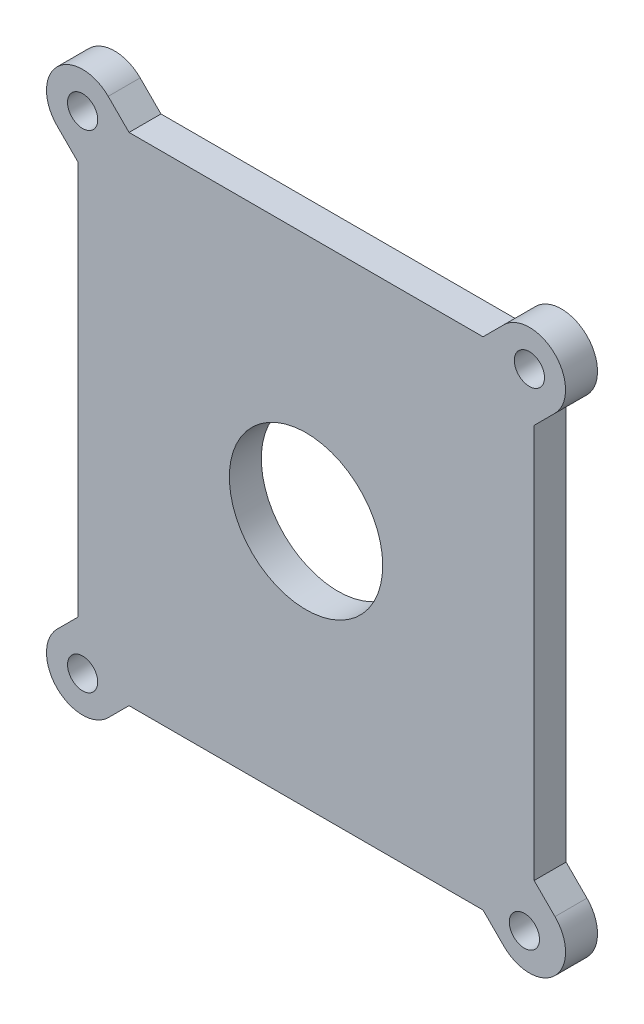
ISO-10303-21;
HEADER;
FILE_DESCRIPTION(('STEP AP214'),'2;1');
FILE_NAME('part.step','',(''),(''),'','','');
FILE_SCHEMA(('AUTOMOTIVE_DESIGN { 1 0 10303 214 1 1 1 1 }'));
ENDSEC;
DATA;
#1=APPLICATION_CONTEXT('core data for automotive mechanical design processes');
#2=APPLICATION_PROTOCOL_DEFINITION('international standard','automotive_design',2000,#1);
#3=PRODUCT_CONTEXT('',#1,'mechanical');
#4=PRODUCT('Part','Part','',(#3));
#5=PRODUCT_RELATED_PRODUCT_CATEGORY('part','',(#4));
#6=PRODUCT_DEFINITION_FORMATION('','',#4);
#7=PRODUCT_DEFINITION_CONTEXT('part definition',#1,'design');
#8=PRODUCT_DEFINITION('design','',#6,#7);
#9=PRODUCT_DEFINITION_SHAPE('','',#8);
#10=(LENGTH_UNIT() NAMED_UNIT(*) SI_UNIT(.MILLI.,.METRE.));
#11=(NAMED_UNIT(*) PLANE_ANGLE_UNIT() SI_UNIT($,.RADIAN.));
#12=(NAMED_UNIT(*) SI_UNIT($,.STERADIAN.) SOLID_ANGLE_UNIT());
#13=UNCERTAINTY_MEASURE_WITH_UNIT(LENGTH_MEASURE(1.E-05),#10,'distance_accuracy_value','');
#14=(GEOMETRIC_REPRESENTATION_CONTEXT(3) GLOBAL_UNCERTAINTY_ASSIGNED_CONTEXT((#13)) GLOBAL_UNIT_ASSIGNED_CONTEXT((#10,
#11,#12)) REPRESENTATION_CONTEXT('',''));
#15=CARTESIAN_POINT('',(0.,0.,0.));
#16=DIRECTION('',(0.,0.,1.));
#17=DIRECTION('',(1.,0.,0.));
#18=AXIS2_PLACEMENT_3D('',#15,#16,#17);
#19=CARTESIAN_POINT('',(-33.9979,0.,4.7625));
#20=DIRECTION('',(-1.,0.,0.));
#21=DIRECTION('',(0.,0.,1.));
#22=AXIS2_PLACEMENT_3D('',#19,#20,#21);
#23=PLANE('',#22);
#24=DIRECTION('',(0.,1.,0.));
#25=VECTOR('',#24,1.);
#26=CARTESIAN_POINT('',(-33.9979,0.,0.));
#27=LINE('',#26,#25);
#28=CARTESIAN_POINT('',(-33.9979,-29.3751,0.));
#29=VERTEX_POINT('',#28);
#30=CARTESIAN_POINT('',(-33.9979,29.3751,0.));
#31=VERTEX_POINT('',#30);
#32=EDGE_CURVE('E179',#29,#31,#27,.T.);
#33=ORIENTED_EDGE('',*,*,#32,.F.);
#34=DIRECTION('',(0.,0.,-1.));
#35=VECTOR('',#34,1.);
#36=CARTESIAN_POINT('',(-33.9979,-29.3751,4.7625));
#37=LINE('',#36,#35);
#38=CARTESIAN_POINT('',(-33.9979,-29.3751,4.7625));
#39=VERTEX_POINT('',#38);
#40=EDGE_CURVE('E166',#39,#29,#37,.T.);
#41=ORIENTED_EDGE('',*,*,#40,.F.);
#42=DIRECTION('',(0.,1.,0.));
#43=VECTOR('',#42,1.);
#44=CARTESIAN_POINT('',(-33.9979,0.,4.7625));
#45=LINE('',#44,#43);
#46=CARTESIAN_POINT('',(-33.9979,29.3751,4.7625));
#47=VERTEX_POINT('',#46);
#48=EDGE_CURVE('E177',#39,#47,#45,.T.);
#49=ORIENTED_EDGE('',*,*,#48,.T.);
#50=DIRECTION('',(0.,0.,-1.));
#51=VECTOR('',#50,1.);
#52=CARTESIAN_POINT('',(-33.9979,29.3751,4.7625));
#53=LINE('',#52,#51);
#54=EDGE_CURVE('E268',#47,#31,#53,.T.);
#55=ORIENTED_EDGE('',*,*,#54,.T.);
#56=EDGE_LOOP('',(#33,#41,#49,#55));
#57=FACE_BOUND('',#56,.T.);
#58=ADVANCED_FACE('F36',(#57),#23,.T.);
#59=CARTESIAN_POINT('',(0.,36.9951,4.7625));
#60=DIRECTION('',(0.,1.,0.));
#61=DIRECTION('',(0.,0.,1.));
#62=AXIS2_PLACEMENT_3D('',#59,#60,#61);
#63=PLANE('',#62);
#64=DIRECTION('',(1.,0.,0.));
#65=VECTOR('',#64,1.);
#66=CARTESIAN_POINT('',(0.,36.9951,0.));
#67=LINE('',#66,#65);
#68=CARTESIAN_POINT('',(-26.3779,36.9951,0.));
#69=VERTEX_POINT('',#68);
#70=CARTESIAN_POINT('',(26.3779,36.9951,0.));
#71=VERTEX_POINT('',#70);
#72=EDGE_CURVE('E207',#69,#71,#67,.T.);
#73=ORIENTED_EDGE('',*,*,#72,.F.);
#74=DIRECTION('',(0.,0.,-1.));
#75=VECTOR('',#74,1.);
#76=CARTESIAN_POINT('',(-26.3779,36.9951,4.7625));
#77=LINE('',#76,#75);
#78=CARTESIAN_POINT('',(-26.3779,36.9951,4.7625));
#79=VERTEX_POINT('',#78);
#80=EDGE_CURVE('E254',#79,#69,#77,.T.);
#81=ORIENTED_EDGE('',*,*,#80,.F.);
#82=DIRECTION('',(1.,0.,0.));
#83=VECTOR('',#82,1.);
#84=CARTESIAN_POINT('',(0.,36.9951,4.7625));
#85=LINE('',#84,#83);
#86=CARTESIAN_POINT('',(26.3779,36.9951,4.7625));
#87=VERTEX_POINT('',#86);
#88=EDGE_CURVE('E188',#79,#87,#85,.T.);
#89=ORIENTED_EDGE('',*,*,#88,.T.);
#90=DIRECTION('',(0.,0.,-1.));
#91=VECTOR('',#90,1.);
#92=CARTESIAN_POINT('',(26.3779,36.9951,4.7625));
#93=LINE('',#92,#91);
#94=EDGE_CURVE('E240',#87,#71,#93,.T.);
#95=ORIENTED_EDGE('',*,*,#94,.T.);
#96=EDGE_LOOP('',(#73,#81,#89,#95));
#97=FACE_BOUND('',#96,.T.);
#98=ADVANCED_FACE('F353',(#97),#63,.T.);
#99=CARTESIAN_POINT('',(33.9979,0.,4.7625));
#100=DIRECTION('',(1.,0.,0.));
#101=DIRECTION('',(0.,1.,0.));
#102=AXIS2_PLACEMENT_3D('',#99,#100,#101);
#103=PLANE('',#102);
#104=DIRECTION('',(0.,-1.,0.));
#105=VECTOR('',#104,1.);
#106=CARTESIAN_POINT('',(33.9979,0.,0.));
#107=LINE('',#106,#105);
#108=CARTESIAN_POINT('',(33.9979,29.3751,0.));
#109=VERTEX_POINT('',#108);
#110=CARTESIAN_POINT('',(33.9979,-29.3751,0.));
#111=VERTEX_POINT('',#110);
#112=EDGE_CURVE('E80',#109,#111,#107,.T.);
#113=ORIENTED_EDGE('',*,*,#112,.F.);
#114=DIRECTION('',(0.,0.,-1.));
#115=VECTOR('',#114,1.);
#116=CARTESIAN_POINT('',(33.9979,29.3751,4.7625));
#117=LINE('',#116,#115);
#118=CARTESIAN_POINT('',(33.9979,29.3751,4.7625));
#119=VERTEX_POINT('',#118);
#120=EDGE_CURVE('E198',#119,#109,#117,.T.);
#121=ORIENTED_EDGE('',*,*,#120,.F.);
#122=DIRECTION('',(0.,-1.,0.));
#123=VECTOR('',#122,1.);
#124=CARTESIAN_POINT('',(33.9979,0.,4.7625));
#125=LINE('',#124,#123);
#126=CARTESIAN_POINT('',(33.9979,-29.3751,4.7625));
#127=VERTEX_POINT('',#126);
#128=EDGE_CURVE('E53',#119,#127,#125,.T.);
#129=ORIENTED_EDGE('',*,*,#128,.T.);
#130=DIRECTION('',(0.,0.,-1.));
#131=VECTOR('',#130,1.);
#132=CARTESIAN_POINT('',(33.9979,-29.3751,4.7625));
#133=LINE('',#132,#131);
#134=EDGE_CURVE('E187',#127,#111,#133,.T.);
#135=ORIENTED_EDGE('',*,*,#134,.T.);
#136=EDGE_LOOP('',(#113,#121,#129,#135));
#137=FACE_BOUND('',#136,.T.);
#138=ADVANCED_FACE('F358',(#137),#103,.T.);
#139=CARTESIAN_POINT('',(0.,-36.9951,4.7625));
#140=DIRECTION('',(0.,1.,0.));
#141=DIRECTION('',(0.,0.,1.));
#142=AXIS2_PLACEMENT_3D('',#139,#140,#141);
#143=PLANE('',#142);
#144=DIRECTION('',(1.,0.,0.));
#145=VECTOR('',#144,1.);
#146=CARTESIAN_POINT('',(0.,-36.9951,4.7625));
#147=LINE('',#146,#145);
#148=CARTESIAN_POINT('',(-26.3779,-36.9951,4.7625));
#149=VERTEX_POINT('',#148);
#150=CARTESIAN_POINT('',(26.3779,-36.9951,4.7625));
#151=VERTEX_POINT('',#150);
#152=EDGE_CURVE('E87',#149,#151,#147,.T.);
#153=ORIENTED_EDGE('',*,*,#152,.F.);
#154=DIRECTION('',(0.,0.,-1.));
#155=VECTOR('',#154,1.);
#156=CARTESIAN_POINT('',(-26.3779,-36.9951,4.7625));
#157=LINE('',#156,#155);
#158=CARTESIAN_POINT('',(-26.3779,-36.9951,0.));
#159=VERTEX_POINT('',#158);
#160=EDGE_CURVE('E285',#149,#159,#157,.T.);
#161=ORIENTED_EDGE('',*,*,#160,.T.);
#162=DIRECTION('',(1.,0.,0.));
#163=VECTOR('',#162,1.);
#164=CARTESIAN_POINT('',(0.,-36.9951,0.));
#165=LINE('',#164,#163);
#166=CARTESIAN_POINT('',(26.3779,-36.9951,0.));
#167=VERTEX_POINT('',#166);
#168=EDGE_CURVE('E197',#159,#167,#165,.T.);
#169=ORIENTED_EDGE('',*,*,#168,.T.);
#170=DIRECTION('',(0.,0.,-1.));
#171=VECTOR('',#170,1.);
#172=CARTESIAN_POINT('',(26.3779,-36.9951,4.7625));
#173=LINE('',#172,#171);
#174=EDGE_CURVE('E11',#151,#167,#173,.T.);
#175=ORIENTED_EDGE('',*,*,#174,.F.);
#176=EDGE_LOOP('',(#153,#161,#169,#175));
#177=FACE_BOUND('',#176,.T.);
#178=ADVANCED_FACE('F365',(#177),#143,.F.);
#179=CARTESIAN_POINT('',(-5.30860000000003,-5.30860000000004,4.7625));
#180=DIRECTION('',(0.707106781186547,0.707106781186548,0.));
#181=DIRECTION('',(-0.707106781186548,0.707106781186547,0.));
#182=AXIS2_PLACEMENT_3D('',#179,#180,#181);
#183=PLANE('',#182);
#184=DIRECTION('',(0.707106781186548,-0.707106781186547,0.));
#185=VECTOR('',#184,1.);
#186=CARTESIAN_POINT('',(-5.30860000000003,-5.30860000000004,0.));
#187=LINE('',#186,#185);
#188=CARTESIAN_POINT('',(29.4838743299566,-40.1010743299566,0.));
#189=VERTEX_POINT('',#188);
#190=EDGE_CURVE('E200',#167,#189,#187,.T.);
#191=ORIENTED_EDGE('',*,*,#190,.T.);
#192=DIRECTION('',(0.,0.,-1.));
#193=VECTOR('',#192,1.);
#194=CARTESIAN_POINT('',(29.4838743299566,-40.1010743299566,4.7625));
#195=LINE('',#194,#193);
#196=CARTESIAN_POINT('',(29.4838743299566,-40.1010743299566,4.7625));
#197=VERTEX_POINT('',#196);
#198=EDGE_CURVE('E45',#197,#189,#195,.T.);
#199=ORIENTED_EDGE('',*,*,#198,.F.);
#200=DIRECTION('',(0.707106781186548,-0.707106781186547,0.));
#201=VECTOR('',#200,1.);
#202=CARTESIAN_POINT('',(-5.30860000000003,-5.30860000000004,4.7625));
#203=LINE('',#202,#201);
#204=EDGE_CURVE('E227',#151,#197,#203,.T.);
#205=ORIENTED_EDGE('',*,*,#204,.F.);
#206=ORIENTED_EDGE('',*,*,#174,.T.);
#207=EDGE_LOOP('',(#191,#199,#205,#206));
#208=FACE_BOUND('',#207,.T.);
#209=ADVANCED_FACE('F370',(#208),#183,.F.);
#210=CARTESIAN_POINT('',(33.2938743299567,-36.2910743299567,4.7625));
#211=DIRECTION('',(0.,0.,-1.));
#212=DIRECTION('',(-1.,0.,0.));
#213=AXIS2_PLACEMENT_3D('',#210,#211,#212);
#214=CYLINDRICAL_SURFACE('',#213,5.38815367264139);
#215=CARTESIAN_POINT('',(33.2938743299567,-36.2910743299567,0.));
#216=DIRECTION('',(0.,0.,1.));
#217=DIRECTION('',(1.,0.,0.));
#218=AXIS2_PLACEMENT_3D('',#215,#216,#217);
#219=CIRCLE('',#218,5.38815367264139);
#220=CARTESIAN_POINT('',(37.1038743299566,-32.4810743299569,0.));
#221=VERTEX_POINT('',#220);
#222=EDGE_CURVE('E202',#189,#221,#219,.T.);
#223=ORIENTED_EDGE('',*,*,#222,.T.);
#224=DIRECTION('',(0.,0.,-1.));
#225=VECTOR('',#224,1.);
#226=CARTESIAN_POINT('',(37.1038743299566,-32.4810743299569,4.7625));
#227=LINE('',#226,#225);
#228=CARTESIAN_POINT('',(37.1038743299566,-32.4810743299569,4.7625));
#229=VERTEX_POINT('',#228);
#230=EDGE_CURVE('E72',#229,#221,#227,.T.);
#231=ORIENTED_EDGE('',*,*,#230,.F.);
#232=CARTESIAN_POINT('',(33.2938743299567,-36.2910743299567,4.7625));
#233=DIRECTION('',(0.,0.,1.));
#234=DIRECTION('',(1.,0.,0.));
#235=AXIS2_PLACEMENT_3D('',#232,#233,#234);
#236=CIRCLE('',#235,5.38815367264139);
#237=EDGE_CURVE('E217',#197,#229,#236,.T.);
#238=ORIENTED_EDGE('',*,*,#237,.F.);
#239=ORIENTED_EDGE('',*,*,#198,.T.);
#240=EDGE_LOOP('',(#223,#231,#238,#239));
#241=FACE_BOUND('',#240,.T.);
#242=ADVANCED_FACE('F216',(#241),#214,.T.);
#243=CARTESIAN_POINT('',(2.31140000000166,2.31140000000143,4.7625));
#244=DIRECTION('',(0.707106781186582,0.707106781186513,0.));
#245=DIRECTION('',(-0.707106781186513,0.707106781186582,0.));
#246=AXIS2_PLACEMENT_3D('',#243,#244,#245);
#247=PLANE('',#246);
#248=DIRECTION('',(0.707106781186513,-0.707106781186582,0.));
#249=VECTOR('',#248,1.);
#250=CARTESIAN_POINT('',(2.31140000000166,2.31140000000143,0.));
#251=LINE('',#250,#249);
#252=EDGE_CURVE('E204',#111,#221,#251,.T.);
#253=ORIENTED_EDGE('',*,*,#252,.F.);
#254=ORIENTED_EDGE('',*,*,#134,.F.);
#255=DIRECTION('',(0.707106781186513,-0.707106781186582,0.));
#256=VECTOR('',#255,1.);
#257=CARTESIAN_POINT('',(2.31140000000166,2.31140000000143,4.7625));
#258=LINE('',#257,#256);
#259=EDGE_CURVE('E225',#127,#229,#258,.T.);
#260=ORIENTED_EDGE('',*,*,#259,.T.);
#261=ORIENTED_EDGE('',*,*,#230,.T.);
#262=EDGE_LOOP('',(#253,#254,#260,#261));
#263=FACE_BOUND('',#262,.T.);
#264=ADVANCED_FACE('F223',(#263),#247,.T.);
#265=CARTESIAN_POINT('',(0.,0.,4.7625));
#266=DIRECTION('',(0.,0.,-1.));
#267=DIRECTION('',(-1.,0.,0.));
#268=AXIS2_PLACEMENT_3D('',#265,#266,#267);
#269=CYLINDRICAL_SURFACE('',#268,11.43);
#270=CARTESIAN_POINT('',(0.,0.,4.7625));
#271=DIRECTION('',(0.,0.,1.));
#272=DIRECTION('',(1.,0.,0.));
#273=AXIS2_PLACEMENT_3D('',#270,#271,#272);
#274=CIRCLE('',#273,11.43);
#275=CARTESIAN_POINT('',(11.43,0.,4.7625));
#276=VERTEX_POINT('',#275);
#277=EDGE_CURVE('E209',#276,#276,#274,.T.);
#278=ORIENTED_EDGE('',*,*,#277,.T.);
#279=EDGE_LOOP('',(#278));
#280=FACE_BOUND('',#279,.T.);
#281=CARTESIAN_POINT('',(0.,0.,0.));
#282=DIRECTION('',(0.,0.,1.));
#283=DIRECTION('',(1.,0.,0.));
#284=AXIS2_PLACEMENT_3D('',#281,#282,#283);
#285=CIRCLE('',#284,11.43);
#286=CARTESIAN_POINT('',(11.43,0.,0.));
#287=VERTEX_POINT('',#286);
#288=EDGE_CURVE('E194',#287,#287,#285,.T.);
#289=ORIENTED_EDGE('',*,*,#288,.F.);
#290=EDGE_LOOP('',(#289));
#291=FACE_BOUND('',#290,.T.);
#292=ADVANCED_FACE('F38',(#280,#291),#269,.F.);
#293=CARTESIAN_POINT('',(0.,0.,4.7625));
#294=DIRECTION('',(0.,0.,1.));
#295=DIRECTION('',(1.,0.,0.));
#296=AXIS2_PLACEMENT_3D('',#293,#294,#295);
#297=PLANE('',#296);
#298=CARTESIAN_POINT('',(-33.2938743299567,36.2910743299567,4.7625));
#299=DIRECTION('',(0.,0.,1.));
#300=DIRECTION('',(1.,0.,0.));
#301=AXIS2_PLACEMENT_3D('',#298,#299,#300);
#302=CIRCLE('',#301,2.24999999999999);
#303=CARTESIAN_POINT('',(-31.0438743299567,36.2910743299567,4.7625));
#304=VERTEX_POINT('',#303);
#305=EDGE_CURVE('E320',#304,#304,#302,.T.);
#306=ORIENTED_EDGE('',*,*,#305,.F.);
#307=EDGE_LOOP('',(#306));
#308=FACE_BOUND('',#307,.T.);
#309=CARTESIAN_POINT('',(33.2938743299567,36.2910743299567,4.7625));
#310=DIRECTION('',(0.,0.,1.));
#311=DIRECTION('',(1.,0.,0.));
#312=AXIS2_PLACEMENT_3D('',#309,#310,#311);
#313=CIRCLE('',#312,2.24999999999999);
#314=CARTESIAN_POINT('',(35.5438743299567,36.2910743299567,4.7625));
#315=VERTEX_POINT('',#314);
#316=EDGE_CURVE('E314',#315,#315,#313,.T.);
#317=ORIENTED_EDGE('',*,*,#316,.F.);
#318=EDGE_LOOP('',(#317));
#319=FACE_BOUND('',#318,.T.);
#320=CARTESIAN_POINT('',(32.5471646817301,-36.5866527319255,4.7625));
#321=DIRECTION('',(0.,0.,1.));
#322=DIRECTION('',(1.,0.,0.));
#323=AXIS2_PLACEMENT_3D('',#320,#321,#322);
#324=CIRCLE('',#323,2.24999999999999);
#325=CARTESIAN_POINT('',(34.7971646817301,-36.5866527319255,4.7625));
#326=VERTEX_POINT('',#325);
#327=EDGE_CURVE('E308',#326,#326,#324,.T.);
#328=ORIENTED_EDGE('',*,*,#327,.F.);
#329=EDGE_LOOP('',(#328));
#330=FACE_BOUND('',#329,.T.);
#331=CARTESIAN_POINT('',(-33.2938743299567,-36.2910743299567,4.7625));
#332=DIRECTION('',(0.,0.,1.));
#333=DIRECTION('',(1.,0.,0.));
#334=AXIS2_PLACEMENT_3D('',#331,#332,#333);
#335=CIRCLE('',#334,2.24999999999999);
#336=CARTESIAN_POINT('',(-31.0438743299567,-36.2910743299567,4.7625));
#337=VERTEX_POINT('',#336);
#338=EDGE_CURVE('E302',#337,#337,#335,.T.);
#339=ORIENTED_EDGE('',*,*,#338,.F.);
#340=EDGE_LOOP('',(#339));
#341=FACE_BOUND('',#340,.T.);
#342=DIRECTION('',(-0.707106781186548,-0.707106781186547,0.));
#343=VECTOR('',#342,1.);
#344=CARTESIAN_POINT('',(5.30860000000003,-5.30860000000004,4.7625));
#345=LINE('',#344,#343);
#346=CARTESIAN_POINT('',(-29.4838743299566,-40.1010743299566,4.7625));
#347=VERTEX_POINT('',#346);
#348=EDGE_CURVE('E288',#149,#347,#345,.T.);
#349=ORIENTED_EDGE('',*,*,#348,.F.);
#350=ORIENTED_EDGE('',*,*,#152,.T.);
#351=ORIENTED_EDGE('',*,*,#204,.T.);
#352=ORIENTED_EDGE('',*,*,#237,.T.);
#353=ORIENTED_EDGE('',*,*,#259,.F.);
#354=ORIENTED_EDGE('',*,*,#128,.F.);
#355=DIRECTION('',(0.707106781186513,0.707106781186582,0.));
#356=VECTOR('',#355,1.);
#357=CARTESIAN_POINT('',(2.31140000000166,-2.31140000000143,4.7625));
#358=LINE('',#357,#356);
#359=CARTESIAN_POINT('',(37.1038743299566,32.4810743299569,4.7625));
#360=VERTEX_POINT('',#359);
#361=EDGE_CURVE('E247',#119,#360,#358,.T.);
#362=ORIENTED_EDGE('',*,*,#361,.T.);
#363=CARTESIAN_POINT('',(33.2938743299567,36.2910743299567,4.7625));
#364=DIRECTION('',(0.,0.,-1.));
#365=DIRECTION('',(1.,0.,0.));
#366=AXIS2_PLACEMENT_3D('',#363,#364,#365);
#367=CIRCLE('',#366,5.38815367264139);
#368=CARTESIAN_POINT('',(29.4838743299566,40.1010743299566,4.7625));
#369=VERTEX_POINT('',#368);
#370=EDGE_CURVE('E257',#369,#360,#367,.T.);
#371=ORIENTED_EDGE('',*,*,#370,.F.);
#372=DIRECTION('',(0.707106781186548,0.707106781186547,0.));
#373=VECTOR('',#372,1.);
#374=CARTESIAN_POINT('',(-5.30860000000003,5.30860000000004,4.7625));
#375=LINE('',#374,#373);
#376=EDGE_CURVE('E243',#87,#369,#375,.T.);
#377=ORIENTED_EDGE('',*,*,#376,.F.);
#378=ORIENTED_EDGE('',*,*,#88,.F.);
#379=DIRECTION('',(-0.707106781186548,0.707106781186547,0.));
#380=VECTOR('',#379,1.);
#381=CARTESIAN_POINT('',(5.30860000000003,5.30860000000004,4.7625));
#382=LINE('',#381,#380);
#383=CARTESIAN_POINT('',(-29.4838743299566,40.1010743299566,4.7625));
#384=VERTEX_POINT('',#383);
#385=EDGE_CURVE('E273',#79,#384,#382,.T.);
#386=ORIENTED_EDGE('',*,*,#385,.T.);
#387=CARTESIAN_POINT('',(-33.2938743299567,36.2910743299567,4.7625));
#388=DIRECTION('',(0.,0.,1.));
#389=DIRECTION('',(-1.,0.,0.));
#390=AXIS2_PLACEMENT_3D('',#387,#388,#389);
#391=CIRCLE('',#390,5.38815367264139);
#392=CARTESIAN_POINT('',(-37.1038743299566,32.4810743299569,4.7625));
#393=VERTEX_POINT('',#392);
#394=EDGE_CURVE('E279',#384,#393,#391,.T.);
#395=ORIENTED_EDGE('',*,*,#394,.T.);
#396=DIRECTION('',(-0.707106781186513,0.707106781186582,0.));
#397=VECTOR('',#396,1.);
#398=CARTESIAN_POINT('',(-2.31140000000166,-2.31140000000143,4.7625));
#399=LINE('',#398,#397);
#400=EDGE_CURVE('E186',#47,#393,#399,.T.);
#401=ORIENTED_EDGE('',*,*,#400,.F.);
#402=ORIENTED_EDGE('',*,*,#48,.F.);
#403=DIRECTION('',(-0.707106781186513,-0.707106781186582,0.));
#404=VECTOR('',#403,1.);
#405=CARTESIAN_POINT('',(-2.31140000000166,2.31140000000143,4.7625));
#406=LINE('',#405,#404);
#407=CARTESIAN_POINT('',(-37.1038743299566,-32.4810743299569,4.7625));
#408=VERTEX_POINT('',#407);
#409=EDGE_CURVE('E162',#39,#408,#406,.T.);
#410=ORIENTED_EDGE('',*,*,#409,.T.);
#411=CARTESIAN_POINT('',(-33.2938743299567,-36.2910743299567,4.7625));
#412=DIRECTION('',(0.,0.,-1.));
#413=DIRECTION('',(-1.,0.,0.));
#414=AXIS2_PLACEMENT_3D('',#411,#412,#413);
#415=CIRCLE('',#414,5.38815367264139);
#416=EDGE_CURVE('E172',#347,#408,#415,.T.);
#417=ORIENTED_EDGE('',*,*,#416,.F.);
#418=EDGE_LOOP('',(#349,#350,#351,#352,#353,#354,#362,#371,#377,#378,#386,#395,#401,#402,#410,#417));
#419=FACE_BOUND('',#418,.T.);
#420=ORIENTED_EDGE('',*,*,#277,.F.);
#421=EDGE_LOOP('',(#420));
#422=FACE_BOUND('',#421,.T.);
#423=ADVANCED_FACE('F183',(#308,#319,#330,#341,#419,#422),#297,.T.);
#424=CARTESIAN_POINT('',(0.,0.,0.));
#425=DIRECTION('',(0.,0.,1.));
#426=DIRECTION('',(1.,0.,0.));
#427=AXIS2_PLACEMENT_3D('',#424,#425,#426);
#428=PLANE('',#427);
#429=CARTESIAN_POINT('',(-33.2938743299567,36.2910743299567,0.));
#430=DIRECTION('',(0.,0.,1.));
#431=DIRECTION('',(1.,0.,0.));
#432=AXIS2_PLACEMENT_3D('',#429,#430,#431);
#433=CIRCLE('',#432,2.25);
#434=CARTESIAN_POINT('',(-31.0438743299567,36.2910743299567,0.));
#435=VERTEX_POINT('',#434);
#436=EDGE_CURVE('E317',#435,#435,#433,.T.);
#437=ORIENTED_EDGE('',*,*,#436,.T.);
#438=EDGE_LOOP('',(#437));
#439=FACE_BOUND('',#438,.T.);
#440=CARTESIAN_POINT('',(33.2938743299567,36.2910743299567,0.));
#441=DIRECTION('',(0.,0.,1.));
#442=DIRECTION('',(1.,0.,0.));
#443=AXIS2_PLACEMENT_3D('',#440,#441,#442);
#444=CIRCLE('',#443,2.25);
#445=CARTESIAN_POINT('',(35.5438743299567,36.2910743299567,0.));
#446=VERTEX_POINT('',#445);
#447=EDGE_CURVE('E311',#446,#446,#444,.T.);
#448=ORIENTED_EDGE('',*,*,#447,.T.);
#449=EDGE_LOOP('',(#448));
#450=FACE_BOUND('',#449,.T.);
#451=CARTESIAN_POINT('',(32.5471646817301,-36.5866527319255,0.));
#452=DIRECTION('',(0.,0.,1.));
#453=DIRECTION('',(1.,0.,0.));
#454=AXIS2_PLACEMENT_3D('',#451,#452,#453);
#455=CIRCLE('',#454,2.25);
#456=CARTESIAN_POINT('',(34.7971646817301,-36.5866527319255,0.));
#457=VERTEX_POINT('',#456);
#458=EDGE_CURVE('E305',#457,#457,#455,.T.);
#459=ORIENTED_EDGE('',*,*,#458,.T.);
#460=EDGE_LOOP('',(#459));
#461=FACE_BOUND('',#460,.T.);
#462=CARTESIAN_POINT('',(-33.2938743299567,-36.2910743299567,0.));
#463=DIRECTION('',(0.,0.,1.));
#464=DIRECTION('',(1.,0.,0.));
#465=AXIS2_PLACEMENT_3D('',#462,#463,#464);
#466=CIRCLE('',#465,2.25);
#467=CARTESIAN_POINT('',(-31.0438743299567,-36.2910743299567,0.));
#468=VERTEX_POINT('',#467);
#469=EDGE_CURVE('E296',#468,#468,#466,.T.);
#470=ORIENTED_EDGE('',*,*,#469,.T.);
#471=EDGE_LOOP('',(#470));
#472=FACE_BOUND('',#471,.T.);
#473=ORIENTED_EDGE('',*,*,#168,.F.);
#474=DIRECTION('',(-0.707106781186548,-0.707106781186547,0.));
#475=VECTOR('',#474,1.);
#476=CARTESIAN_POINT('',(5.30860000000003,-5.30860000000004,0.));
#477=LINE('',#476,#475);
#478=CARTESIAN_POINT('',(-29.4838743299566,-40.1010743299566,0.));
#479=VERTEX_POINT('',#478);
#480=EDGE_CURVE('E173',#159,#479,#477,.T.);
#481=ORIENTED_EDGE('',*,*,#480,.T.);
#482=CARTESIAN_POINT('',(-33.2938743299567,-36.2910743299567,0.));
#483=DIRECTION('',(0.,0.,-1.));
#484=DIRECTION('',(-1.,0.,0.));
#485=AXIS2_PLACEMENT_3D('',#482,#483,#484);
#486=CIRCLE('',#485,5.38815367264139);
#487=CARTESIAN_POINT('',(-37.1038743299566,-32.4810743299569,0.));
#488=VERTEX_POINT('',#487);
#489=EDGE_CURVE('E291',#479,#488,#486,.T.);
#490=ORIENTED_EDGE('',*,*,#489,.T.);
#491=DIRECTION('',(-0.707106781186513,-0.707106781186582,0.));
#492=VECTOR('',#491,1.);
#493=CARTESIAN_POINT('',(-2.31140000000166,2.31140000000143,0.));
#494=LINE('',#493,#492);
#495=EDGE_CURVE('E294',#29,#488,#494,.T.);
#496=ORIENTED_EDGE('',*,*,#495,.F.);
#497=ORIENTED_EDGE('',*,*,#32,.T.);
#498=DIRECTION('',(-0.707106781186513,0.707106781186582,0.));
#499=VECTOR('',#498,1.);
#500=CARTESIAN_POINT('',(-2.31140000000166,-2.31140000000143,0.));
#501=LINE('',#500,#499);
#502=CARTESIAN_POINT('',(-37.1038743299566,32.4810743299569,0.));
#503=VERTEX_POINT('',#502);
#504=EDGE_CURVE('E270',#31,#503,#501,.T.);
#505=ORIENTED_EDGE('',*,*,#504,.T.);
#506=CARTESIAN_POINT('',(-33.2938743299567,36.2910743299567,0.));
#507=DIRECTION('',(0.,0.,1.));
#508=DIRECTION('',(-1.,0.,0.));
#509=AXIS2_PLACEMENT_3D('',#506,#507,#508);
#510=CIRCLE('',#509,5.38815367264139);
#511=CARTESIAN_POINT('',(-29.4838743299566,40.1010743299566,0.));
#512=VERTEX_POINT('',#511);
#513=EDGE_CURVE('E274',#512,#503,#510,.T.);
#514=ORIENTED_EDGE('',*,*,#513,.F.);
#515=DIRECTION('',(-0.707106781186548,0.707106781186547,0.));
#516=VECTOR('',#515,1.);
#517=CARTESIAN_POINT('',(5.30860000000003,5.30860000000004,0.));
#518=LINE('',#517,#516);
#519=EDGE_CURVE('E180',#69,#512,#518,.T.);
#520=ORIENTED_EDGE('',*,*,#519,.F.);
#521=ORIENTED_EDGE('',*,*,#72,.T.);
#522=DIRECTION('',(0.707106781186548,0.707106781186547,0.));
#523=VECTOR('',#522,1.);
#524=CARTESIAN_POINT('',(-5.30860000000003,5.30860000000004,0.));
#525=LINE('',#524,#523);
#526=CARTESIAN_POINT('',(29.4838743299566,40.1010743299566,0.));
#527=VERTEX_POINT('',#526);
#528=EDGE_CURVE('E244',#71,#527,#525,.T.);
#529=ORIENTED_EDGE('',*,*,#528,.T.);
#530=CARTESIAN_POINT('',(33.2938743299567,36.2910743299567,0.));
#531=DIRECTION('',(0.,0.,-1.));
#532=DIRECTION('',(1.,0.,0.));
#533=AXIS2_PLACEMENT_3D('',#530,#531,#532);
#534=CIRCLE('',#533,5.38815367264139);
#535=CARTESIAN_POINT('',(37.1038743299566,32.4810743299569,0.));
#536=VERTEX_POINT('',#535);
#537=EDGE_CURVE('E248',#527,#536,#534,.T.);
#538=ORIENTED_EDGE('',*,*,#537,.T.);
#539=DIRECTION('',(0.707106781186513,0.707106781186582,0.));
#540=VECTOR('',#539,1.);
#541=CARTESIAN_POINT('',(2.31140000000166,-2.31140000000143,0.));
#542=LINE('',#541,#540);
#543=EDGE_CURVE('E251',#109,#536,#542,.T.);
#544=ORIENTED_EDGE('',*,*,#543,.F.);
#545=ORIENTED_EDGE('',*,*,#112,.T.);
#546=ORIENTED_EDGE('',*,*,#252,.T.);
#547=ORIENTED_EDGE('',*,*,#222,.F.);
#548=ORIENTED_EDGE('',*,*,#190,.F.);
#549=EDGE_LOOP('',(#473,#481,#490,#496,#497,#505,#514,#520,#521,#529,#538,#544,#545,#546,#547,#548));
#550=FACE_BOUND('',#549,.T.);
#551=ORIENTED_EDGE('',*,*,#288,.T.);
#552=EDGE_LOOP('',(#551));
#553=FACE_BOUND('',#552,.T.);
#554=ADVANCED_FACE('F221',(#439,#450,#461,#472,#550,#553),#428,.F.);
#555=CARTESIAN_POINT('',(33.2938743299567,36.2910743299567,4.7625));
#556=DIRECTION('',(0.,0.,-1.));
#557=DIRECTION('',(-1.,0.,0.));
#558=AXIS2_PLACEMENT_3D('',#555,#556,#557);
#559=CYLINDRICAL_SURFACE('',#558,5.38815367264139);
#560=ORIENTED_EDGE('',*,*,#537,.F.);
#561=DIRECTION('',(0.,0.,-1.));
#562=VECTOR('',#561,1.);
#563=CARTESIAN_POINT('',(29.4838743299566,40.1010743299566,4.7625));
#564=LINE('',#563,#562);
#565=EDGE_CURVE('E238',#369,#527,#564,.T.);
#566=ORIENTED_EDGE('',*,*,#565,.F.);
#567=ORIENTED_EDGE('',*,*,#370,.T.);
#568=DIRECTION('',(0.,0.,-1.));
#569=VECTOR('',#568,1.);
#570=CARTESIAN_POINT('',(37.1038743299566,32.4810743299569,4.7625));
#571=LINE('',#570,#569);
#572=EDGE_CURVE('E236',#360,#536,#571,.T.);
#573=ORIENTED_EDGE('',*,*,#572,.T.);
#574=EDGE_LOOP('',(#560,#566,#567,#573));
#575=FACE_BOUND('',#574,.T.);
#576=ADVANCED_FACE('F402',(#575),#559,.T.);
#577=CARTESIAN_POINT('',(-5.30860000000003,5.30860000000004,4.7625));
#578=DIRECTION('',(-0.707106781186547,0.707106781186548,0.));
#579=DIRECTION('',(-0.707106781186548,-0.707106781186547,0.));
#580=AXIS2_PLACEMENT_3D('',#577,#578,#579);
#581=PLANE('',#580);
#582=ORIENTED_EDGE('',*,*,#528,.F.);
#583=ORIENTED_EDGE('',*,*,#94,.F.);
#584=ORIENTED_EDGE('',*,*,#376,.T.);
#585=ORIENTED_EDGE('',*,*,#565,.T.);
#586=EDGE_LOOP('',(#582,#583,#584,#585));
#587=FACE_BOUND('',#586,.T.);
#588=ADVANCED_FACE('F397',(#587),#581,.T.);
#589=CARTESIAN_POINT('',(2.31140000000166,-2.31140000000143,4.7625));
#590=DIRECTION('',(-0.707106781186582,0.707106781186513,0.));
#591=DIRECTION('',(-0.707106781186513,-0.707106781186582,0.));
#592=AXIS2_PLACEMENT_3D('',#589,#590,#591);
#593=PLANE('',#592);
#594=ORIENTED_EDGE('',*,*,#543,.T.);
#595=ORIENTED_EDGE('',*,*,#572,.F.);
#596=ORIENTED_EDGE('',*,*,#361,.F.);
#597=ORIENTED_EDGE('',*,*,#120,.T.);
#598=EDGE_LOOP('',(#594,#595,#596,#597));
#599=FACE_BOUND('',#598,.T.);
#600=ADVANCED_FACE('F404',(#599),#593,.F.);
#601=CARTESIAN_POINT('',(5.30860000000003,5.30860000000004,4.7625));
#602=DIRECTION('',(-0.707106781186547,-0.707106781186548,0.));
#603=DIRECTION('',(0.707106781186548,-0.707106781186547,0.));
#604=AXIS2_PLACEMENT_3D('',#601,#602,#603);
#605=PLANE('',#604);
#606=ORIENTED_EDGE('',*,*,#519,.T.);
#607=DIRECTION('',(0.,0.,-1.));
#608=VECTOR('',#607,1.);
#609=CARTESIAN_POINT('',(-29.4838743299566,40.1010743299566,4.7625));
#610=LINE('',#609,#608);
#611=EDGE_CURVE('E263',#384,#512,#610,.T.);
#612=ORIENTED_EDGE('',*,*,#611,.F.);
#613=ORIENTED_EDGE('',*,*,#385,.F.);
#614=ORIENTED_EDGE('',*,*,#80,.T.);
#615=EDGE_LOOP('',(#606,#612,#613,#614));
#616=FACE_BOUND('',#615,.T.);
#617=ADVANCED_FACE('F392',(#616),#605,.F.);
#618=CARTESIAN_POINT('',(-33.2938743299567,36.2910743299567,4.7625));
#619=DIRECTION('',(0.,0.,-1.));
#620=DIRECTION('',(-1.,0.,0.));
#621=AXIS2_PLACEMENT_3D('',#618,#619,#620);
#622=CYLINDRICAL_SURFACE('',#621,5.38815367264139);
#623=ORIENTED_EDGE('',*,*,#513,.T.);
#624=DIRECTION('',(0.,0.,-1.));
#625=VECTOR('',#624,1.);
#626=CARTESIAN_POINT('',(-37.1038743299566,32.4810743299569,4.7625));
#627=LINE('',#626,#625);
#628=EDGE_CURVE('E266',#393,#503,#627,.T.);
#629=ORIENTED_EDGE('',*,*,#628,.F.);
#630=ORIENTED_EDGE('',*,*,#394,.F.);
#631=ORIENTED_EDGE('',*,*,#611,.T.);
#632=EDGE_LOOP('',(#623,#629,#630,#631));
#633=FACE_BOUND('',#632,.T.);
#634=ADVANCED_FACE('F386',(#633),#622,.T.);
#635=CARTESIAN_POINT('',(-2.31140000000166,-2.31140000000143,4.7625));
#636=DIRECTION('',(-0.707106781186582,-0.707106781186513,0.));
#637=DIRECTION('',(0.707106781186513,-0.707106781186582,0.));
#638=AXIS2_PLACEMENT_3D('',#635,#636,#637);
#639=PLANE('',#638);
#640=ORIENTED_EDGE('',*,*,#504,.F.);
#641=ORIENTED_EDGE('',*,*,#54,.F.);
#642=ORIENTED_EDGE('',*,*,#400,.T.);
#643=ORIENTED_EDGE('',*,*,#628,.T.);
#644=EDGE_LOOP('',(#640,#641,#642,#643));
#645=FACE_BOUND('',#644,.T.);
#646=ADVANCED_FACE('F382',(#645),#639,.T.);
#647=CARTESIAN_POINT('',(-2.31140000000166,2.31140000000143,4.7625));
#648=DIRECTION('',(0.707106781186582,-0.707106781186513,0.));
#649=DIRECTION('',(0.707106781186513,0.707106781186582,0.));
#650=AXIS2_PLACEMENT_3D('',#647,#648,#649);
#651=PLANE('',#650);
#652=ORIENTED_EDGE('',*,*,#495,.T.);
#653=DIRECTION('',(0.,0.,-1.));
#654=VECTOR('',#653,1.);
#655=CARTESIAN_POINT('',(-37.1038743299566,-32.4810743299569,4.7625));
#656=LINE('',#655,#654);
#657=EDGE_CURVE('E168',#408,#488,#656,.T.);
#658=ORIENTED_EDGE('',*,*,#657,.F.);
#659=ORIENTED_EDGE('',*,*,#409,.F.);
#660=ORIENTED_EDGE('',*,*,#40,.T.);
#661=EDGE_LOOP('',(#652,#658,#659,#660));
#662=FACE_BOUND('',#661,.T.);
#663=ADVANCED_FACE('F165',(#662),#651,.F.);
#664=CARTESIAN_POINT('',(-33.2938743299567,-36.2910743299567,4.7625));
#665=DIRECTION('',(0.,0.,-1.));
#666=DIRECTION('',(-1.,0.,0.));
#667=AXIS2_PLACEMENT_3D('',#664,#665,#666);
#668=CYLINDRICAL_SURFACE('',#667,5.38815367264139);
#669=ORIENTED_EDGE('',*,*,#489,.F.);
#670=DIRECTION('',(0.,0.,-1.));
#671=VECTOR('',#670,1.);
#672=CARTESIAN_POINT('',(-29.4838743299566,-40.1010743299566,4.7625));
#673=LINE('',#672,#671);
#674=EDGE_CURVE('E283',#347,#479,#673,.T.);
#675=ORIENTED_EDGE('',*,*,#674,.F.);
#676=ORIENTED_EDGE('',*,*,#416,.T.);
#677=ORIENTED_EDGE('',*,*,#657,.T.);
#678=EDGE_LOOP('',(#669,#675,#676,#677));
#679=FACE_BOUND('',#678,.T.);
#680=ADVANCED_FACE('F348',(#679),#668,.T.);
#681=CARTESIAN_POINT('',(5.30860000000003,-5.30860000000004,4.7625));
#682=DIRECTION('',(0.707106781186547,-0.707106781186548,0.));
#683=DIRECTION('',(0.707106781186548,0.707106781186547,0.));
#684=AXIS2_PLACEMENT_3D('',#681,#682,#683);
#685=PLANE('',#684);
#686=ORIENTED_EDGE('',*,*,#480,.F.);
#687=ORIENTED_EDGE('',*,*,#160,.F.);
#688=ORIENTED_EDGE('',*,*,#348,.T.);
#689=ORIENTED_EDGE('',*,*,#674,.T.);
#690=EDGE_LOOP('',(#686,#687,#688,#689));
#691=FACE_BOUND('',#690,.T.);
#692=ADVANCED_FACE('F338',(#691),#685,.T.);
#693=CARTESIAN_POINT('',(-33.2938743299567,-36.2910743299567,4.7625));
#694=DIRECTION('',(0.,0.,1.));
#695=DIRECTION('',(1.,0.,0.));
#696=AXIS2_PLACEMENT_3D('',#693,#694,#695);
#697=CYLINDRICAL_SURFACE('',#696,2.24999999999999);
#698=ORIENTED_EDGE('',*,*,#469,.F.);
#699=EDGE_LOOP('',(#698));
#700=FACE_BOUND('',#699,.T.);
#701=ORIENTED_EDGE('',*,*,#338,.T.);
#702=EDGE_LOOP('',(#701));
#703=FACE_BOUND('',#702,.T.);
#704=ADVANCED_FACE('F335',(#700,#703),#697,.F.);
#705=CARTESIAN_POINT('',(32.5471646817301,-36.5866527319255,4.7625));
#706=DIRECTION('',(0.,0.,1.));
#707=DIRECTION('',(1.,0.,0.));
#708=AXIS2_PLACEMENT_3D('',#705,#706,#707);
#709=CYLINDRICAL_SURFACE('',#708,2.25);
#710=ORIENTED_EDGE('',*,*,#458,.F.);
#711=EDGE_LOOP('',(#710));
#712=FACE_BOUND('',#711,.T.);
#713=ORIENTED_EDGE('',*,*,#327,.T.);
#714=EDGE_LOOP('',(#713));
#715=FACE_BOUND('',#714,.T.);
#716=ADVANCED_FACE('F337',(#712,#715),#709,.F.);
#717=CARTESIAN_POINT('',(33.2938743299567,36.2910743299567,4.7625));
#718=DIRECTION('',(0.,0.,1.));
#719=DIRECTION('',(1.,0.,0.));
#720=AXIS2_PLACEMENT_3D('',#717,#718,#719);
#721=CYLINDRICAL_SURFACE('',#720,2.25);
#722=ORIENTED_EDGE('',*,*,#447,.F.);
#723=EDGE_LOOP('',(#722));
#724=FACE_BOUND('',#723,.T.);
#725=ORIENTED_EDGE('',*,*,#316,.T.);
#726=EDGE_LOOP('',(#725));
#727=FACE_BOUND('',#726,.T.);
#728=ADVANCED_FACE('F345',(#724,#727),#721,.F.);
#729=CARTESIAN_POINT('',(-33.2938743299567,36.2910743299567,4.7625));
#730=DIRECTION('',(0.,0.,1.));
#731=DIRECTION('',(1.,0.,0.));
#732=AXIS2_PLACEMENT_3D('',#729,#730,#731);
#733=CYLINDRICAL_SURFACE('',#732,2.24999999999999);
#734=ORIENTED_EDGE('',*,*,#436,.F.);
#735=EDGE_LOOP('',(#734));
#736=FACE_BOUND('',#735,.T.);
#737=ORIENTED_EDGE('',*,*,#305,.T.);
#738=EDGE_LOOP('',(#737));
#739=FACE_BOUND('',#738,.T.);
#740=ADVANCED_FACE('F324',(#736,#739),#733,.F.);
#741=CLOSED_SHELL('',(#58,#98,#138,#178,#209,#242,#264,#292,#423,#554,#576,#588,#600,#617,#634,
#646,#663,#680,#692,#704,#716,#728,#740));
#742=MANIFOLD_SOLID_BREP('B2',#741);
#743=ADVANCED_BREP_SHAPE_REPRESENTATION('',(#18,#742),#14);
#744=SHAPE_DEFINITION_REPRESENTATION(#9,#743);
ENDSEC;
END-ISO-10303-21;
